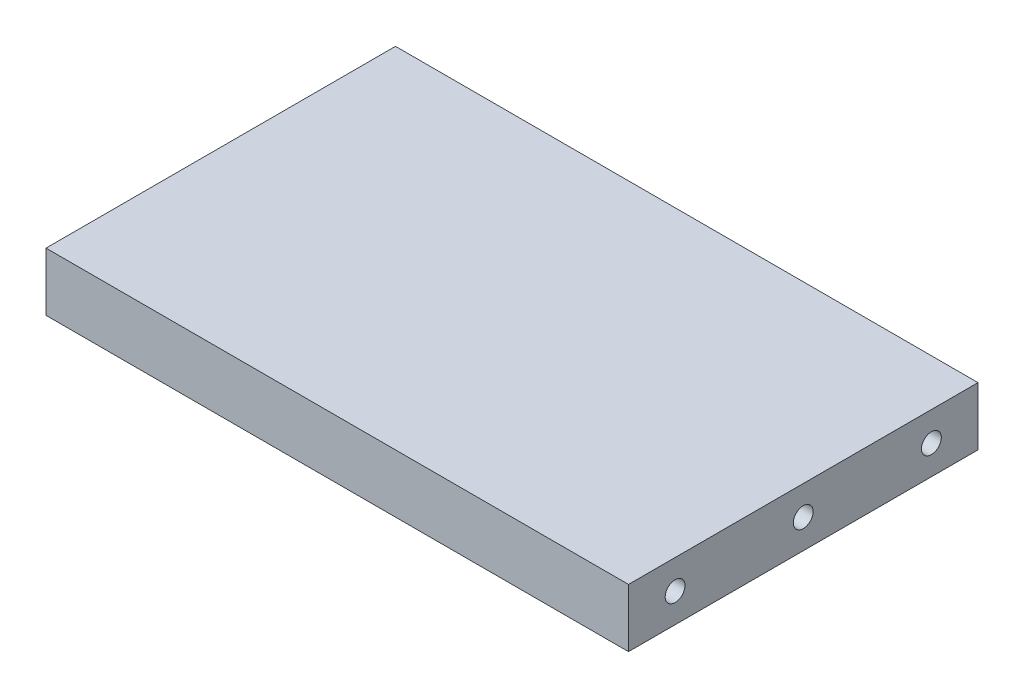
ISO-10303-21;
HEADER;
FILE_DESCRIPTION(('STEP AP214'),'2;1');
FILE_NAME('part.step','',(''),(''),'','','');
FILE_SCHEMA(('AUTOMOTIVE_DESIGN { 1 0 10303 214 1 1 1 1 }'));
ENDSEC;
DATA;
#1=APPLICATION_CONTEXT('core data for automotive mechanical design processes');
#2=APPLICATION_PROTOCOL_DEFINITION('international standard','automotive_design',2000,#1);
#3=PRODUCT_CONTEXT('',#1,'mechanical');
#4=PRODUCT('Part','Part','',(#3));
#5=PRODUCT_RELATED_PRODUCT_CATEGORY('part','',(#4));
#6=PRODUCT_DEFINITION_FORMATION('','',#4);
#7=PRODUCT_DEFINITION_CONTEXT('part definition',#1,'design');
#8=PRODUCT_DEFINITION('design','',#6,#7);
#9=PRODUCT_DEFINITION_SHAPE('','',#8);
#10=(LENGTH_UNIT() NAMED_UNIT(*) SI_UNIT(.MILLI.,.METRE.));
#11=(NAMED_UNIT(*) PLANE_ANGLE_UNIT() SI_UNIT($,.RADIAN.));
#12=(NAMED_UNIT(*) SI_UNIT($,.STERADIAN.) SOLID_ANGLE_UNIT());
#13=UNCERTAINTY_MEASURE_WITH_UNIT(LENGTH_MEASURE(1.E-05),#10,'distance_accuracy_value','');
#14=(GEOMETRIC_REPRESENTATION_CONTEXT(3) GLOBAL_UNCERTAINTY_ASSIGNED_CONTEXT((#13)) GLOBAL_UNIT_ASSIGNED_CONTEXT((#10,
#11,#12)) REPRESENTATION_CONTEXT('',''));
#15=CARTESIAN_POINT('',(0.,0.,0.));
#16=DIRECTION('',(0.,0.,1.));
#17=DIRECTION('',(1.,0.,0.));
#18=AXIS2_PLACEMENT_3D('',#15,#16,#17);
#19=CARTESIAN_POINT('',(50.,10.,30.));
#20=DIRECTION('',(-1.,0.,0.));
#21=DIRECTION('',(0.,0.,1.));
#22=AXIS2_PLACEMENT_3D('',#19,#20,#21);
#23=PLANE('',#22);
#24=CARTESIAN_POINT('',(50.,5.,-22.0000000000002));
#25=DIRECTION('',(-1.,0.,0.));
#26=DIRECTION('',(0.,0.,1.));
#27=AXIS2_PLACEMENT_3D('',#24,#25,#26);
#28=CIRCLE('',#27,1.69999999999999);
#29=CARTESIAN_POINT('',(50.,5.,-20.3000000000002));
#30=VERTEX_POINT('',#29);
#31=EDGE_CURVE('E131',#30,#30,#28,.T.);
#32=ORIENTED_EDGE('',*,*,#31,.T.);
#33=EDGE_LOOP('',(#32));
#34=FACE_BOUND('',#33,.T.);
#35=CARTESIAN_POINT('',(50.,5.,21.9999999999998));
#36=DIRECTION('',(-1.,0.,0.));
#37=DIRECTION('',(0.,0.,1.));
#38=AXIS2_PLACEMENT_3D('',#35,#36,#37);
#39=CIRCLE('',#38,1.69999999999999);
#40=CARTESIAN_POINT('',(50.,5.,23.6999999999998));
#41=VERTEX_POINT('',#40);
#42=EDGE_CURVE('E135',#41,#41,#39,.T.);
#43=ORIENTED_EDGE('',*,*,#42,.T.);
#44=EDGE_LOOP('',(#43));
#45=FACE_BOUND('',#44,.T.);
#46=CARTESIAN_POINT('',(50.,5.,-2.22044604925031E-13));
#47=DIRECTION('',(-1.,0.,0.));
#48=DIRECTION('',(0.,0.,1.));
#49=AXIS2_PLACEMENT_3D('',#46,#47,#48);
#50=CIRCLE('',#49,1.69999999999999);
#51=CARTESIAN_POINT('',(50.,5.,1.69999999999977));
#52=VERTEX_POINT('',#51);
#53=EDGE_CURVE('E139',#52,#52,#50,.T.);
#54=ORIENTED_EDGE('',*,*,#53,.T.);
#55=EDGE_LOOP('',(#54));
#56=FACE_BOUND('',#55,.T.);
#57=DIRECTION('',(0.,0.,-1.));
#58=VECTOR('',#57,1.);
#59=CARTESIAN_POINT('',(50.,0.,30.));
#60=LINE('',#59,#58);
#61=CARTESIAN_POINT('',(50.,0.,30.));
#62=VERTEX_POINT('',#61);
#63=CARTESIAN_POINT('',(50.,0.,-30.));
#64=VERTEX_POINT('',#63);
#65=EDGE_CURVE('E147',#62,#64,#60,.T.);
#66=ORIENTED_EDGE('',*,*,#65,.T.);
#67=DIRECTION('',(0.,-1.,0.));
#68=VECTOR('',#67,1.);
#69=CARTESIAN_POINT('',(50.,10.,-30.));
#70=LINE('',#69,#68);
#71=CARTESIAN_POINT('',(50.,10.,-30.));
#72=VERTEX_POINT('',#71);
#73=EDGE_CURVE('E11',#72,#64,#70,.T.);
#74=ORIENTED_EDGE('',*,*,#73,.F.);
#75=DIRECTION('',(0.,0.,-1.));
#76=VECTOR('',#75,1.);
#77=CARTESIAN_POINT('',(50.,10.,30.));
#78=LINE('',#77,#76);
#79=CARTESIAN_POINT('',(50.,10.,30.));
#80=VERTEX_POINT('',#79);
#81=EDGE_CURVE('E140',#80,#72,#78,.T.);
#82=ORIENTED_EDGE('',*,*,#81,.F.);
#83=DIRECTION('',(0.,-1.,0.));
#84=VECTOR('',#83,1.);
#85=CARTESIAN_POINT('',(50.,10.,30.));
#86=LINE('',#85,#84);
#87=EDGE_CURVE('E146',#80,#62,#86,.T.);
#88=ORIENTED_EDGE('',*,*,#87,.T.);
#89=EDGE_LOOP('',(#66,#74,#82,#88));
#90=FACE_BOUND('',#89,.T.);
#91=ADVANCED_FACE('F40',(#34,#45,#56,#90),#23,.F.);
#92=CARTESIAN_POINT('',(-50.,10.,-30.));
#93=DIRECTION('',(0.,0.,1.));
#94=DIRECTION('',(1.,0.,0.));
#95=AXIS2_PLACEMENT_3D('',#92,#93,#94);
#96=PLANE('',#95);
#97=DIRECTION('',(-1.,0.,0.));
#98=VECTOR('',#97,1.);
#99=CARTESIAN_POINT('',(-50.,0.,-30.));
#100=LINE('',#99,#98);
#101=CARTESIAN_POINT('',(-50.,0.,-30.));
#102=VERTEX_POINT('',#101);
#103=EDGE_CURVE('E150',#64,#102,#100,.T.);
#104=ORIENTED_EDGE('',*,*,#103,.T.);
#105=DIRECTION('',(0.,-1.,0.));
#106=VECTOR('',#105,1.);
#107=CARTESIAN_POINT('',(-50.,10.,-30.));
#108=LINE('',#107,#106);
#109=CARTESIAN_POINT('',(-50.,10.,-30.));
#110=VERTEX_POINT('',#109);
#111=EDGE_CURVE('E49',#110,#102,#108,.T.);
#112=ORIENTED_EDGE('',*,*,#111,.F.);
#113=DIRECTION('',(-1.,0.,0.));
#114=VECTOR('',#113,1.);
#115=CARTESIAN_POINT('',(-50.,10.,-30.));
#116=LINE('',#115,#114);
#117=EDGE_CURVE('E89',#72,#110,#116,.T.);
#118=ORIENTED_EDGE('',*,*,#117,.F.);
#119=ORIENTED_EDGE('',*,*,#73,.T.);
#120=EDGE_LOOP('',(#104,#112,#118,#119));
#121=FACE_BOUND('',#120,.T.);
#122=ADVANCED_FACE('F188',(#121),#96,.F.);
#123=CARTESIAN_POINT('',(-50.,10.,30.));
#124=DIRECTION('',(1.,0.,0.));
#125=DIRECTION('',(0.,0.,-1.));
#126=AXIS2_PLACEMENT_3D('',#123,#124,#125);
#127=PLANE('',#126);
#128=CARTESIAN_POINT('',(-50.,5.,-22.0000000000002));
#129=DIRECTION('',(1.,0.,0.));
#130=DIRECTION('',(0.,0.,-1.));
#131=AXIS2_PLACEMENT_3D('',#128,#129,#130);
#132=CIRCLE('',#131,1.69999999999999);
#133=CARTESIAN_POINT('',(-50.,5.,-23.7000000000002));
#134=VERTEX_POINT('',#133);
#135=EDGE_CURVE('E43',#134,#134,#132,.T.);
#136=ORIENTED_EDGE('',*,*,#135,.T.);
#137=EDGE_LOOP('',(#136));
#138=FACE_BOUND('',#137,.T.);
#139=CARTESIAN_POINT('',(-50.,5.,21.9999999999998));
#140=DIRECTION('',(1.,0.,0.));
#141=DIRECTION('',(0.,0.,-1.));
#142=AXIS2_PLACEMENT_3D('',#139,#140,#141);
#143=CIRCLE('',#142,1.69999999999999);
#144=CARTESIAN_POINT('',(-50.,5.,20.2999999999998));
#145=VERTEX_POINT('',#144);
#146=EDGE_CURVE('E123',#145,#145,#143,.T.);
#147=ORIENTED_EDGE('',*,*,#146,.T.);
#148=EDGE_LOOP('',(#147));
#149=FACE_BOUND('',#148,.T.);
#150=CARTESIAN_POINT('',(-50.,5.,-2.22044604925031E-13));
#151=DIRECTION('',(1.,0.,0.));
#152=DIRECTION('',(0.,0.,-1.));
#153=AXIS2_PLACEMENT_3D('',#150,#151,#152);
#154=CIRCLE('',#153,1.69999999999999);
#155=CARTESIAN_POINT('',(-50.,5.,-1.70000000000022));
#156=VERTEX_POINT('',#155);
#157=EDGE_CURVE('E127',#156,#156,#154,.T.);
#158=ORIENTED_EDGE('',*,*,#157,.T.);
#159=EDGE_LOOP('',(#158));
#160=FACE_BOUND('',#159,.T.);
#161=DIRECTION('',(0.,0.,1.));
#162=VECTOR('',#161,1.);
#163=CARTESIAN_POINT('',(-50.,0.,30.));
#164=LINE('',#163,#162);
#165=CARTESIAN_POINT('',(-50.,0.,30.));
#166=VERTEX_POINT('',#165);
#167=EDGE_CURVE('E76',#102,#166,#164,.T.);
#168=ORIENTED_EDGE('',*,*,#167,.T.);
#169=DIRECTION('',(0.,-1.,0.));
#170=VECTOR('',#169,1.);
#171=CARTESIAN_POINT('',(-50.,10.,30.));
#172=LINE('',#171,#170);
#173=CARTESIAN_POINT('',(-50.,10.,30.));
#174=VERTEX_POINT('',#173);
#175=EDGE_CURVE('E155',#174,#166,#172,.T.);
#176=ORIENTED_EDGE('',*,*,#175,.F.);
#177=DIRECTION('',(0.,0.,1.));
#178=VECTOR('',#177,1.);
#179=CARTESIAN_POINT('',(-50.,10.,30.));
#180=LINE('',#179,#178);
#181=EDGE_CURVE('E143',#110,#174,#180,.T.);
#182=ORIENTED_EDGE('',*,*,#181,.F.);
#183=ORIENTED_EDGE('',*,*,#111,.T.);
#184=EDGE_LOOP('',(#168,#176,#182,#183));
#185=FACE_BOUND('',#184,.T.);
#186=ADVANCED_FACE('F168',(#138,#149,#160,#185),#127,.F.);
#187=CARTESIAN_POINT('',(-50.,10.,30.));
#188=DIRECTION('',(0.,0.,-1.));
#189=DIRECTION('',(-1.,0.,0.));
#190=AXIS2_PLACEMENT_3D('',#187,#188,#189);
#191=PLANE('',#190);
#192=DIRECTION('',(1.,0.,0.));
#193=VECTOR('',#192,1.);
#194=CARTESIAN_POINT('',(-50.,0.,30.));
#195=LINE('',#194,#193);
#196=EDGE_CURVE('E82',#166,#62,#195,.T.);
#197=ORIENTED_EDGE('',*,*,#196,.T.);
#198=ORIENTED_EDGE('',*,*,#87,.F.);
#199=DIRECTION('',(1.,0.,0.));
#200=VECTOR('',#199,1.);
#201=CARTESIAN_POINT('',(-50.,10.,30.));
#202=LINE('',#201,#200);
#203=EDGE_CURVE('E58',#174,#80,#202,.T.);
#204=ORIENTED_EDGE('',*,*,#203,.F.);
#205=ORIENTED_EDGE('',*,*,#175,.T.);
#206=EDGE_LOOP('',(#197,#198,#204,#205));
#207=FACE_BOUND('',#206,.T.);
#208=ADVANCED_FACE('F209',(#207),#191,.F.);
#209=CARTESIAN_POINT('',(0.,10.,0.));
#210=DIRECTION('',(0.,-1.,0.));
#211=DIRECTION('',(0.,0.,-1.));
#212=AXIS2_PLACEMENT_3D('',#209,#210,#211);
#213=PLANE('',#212);
#214=ORIENTED_EDGE('',*,*,#81,.T.);
#215=ORIENTED_EDGE('',*,*,#117,.T.);
#216=ORIENTED_EDGE('',*,*,#181,.T.);
#217=ORIENTED_EDGE('',*,*,#203,.T.);
#218=EDGE_LOOP('',(#214,#215,#216,#217));
#219=FACE_BOUND('',#218,.T.);
#220=ADVANCED_FACE('F207',(#219),#213,.F.);
#221=CARTESIAN_POINT('',(0.,0.,0.));
#222=DIRECTION('',(0.,-1.,0.));
#223=DIRECTION('',(0.,0.,-1.));
#224=AXIS2_PLACEMENT_3D('',#221,#222,#223);
#225=PLANE('',#224);
#226=ORIENTED_EDGE('',*,*,#65,.F.);
#227=ORIENTED_EDGE('',*,*,#196,.F.);
#228=ORIENTED_EDGE('',*,*,#167,.F.);
#229=ORIENTED_EDGE('',*,*,#103,.F.);
#230=EDGE_LOOP('',(#226,#227,#228,#229));
#231=FACE_BOUND('',#230,.T.);
#232=ADVANCED_FACE('F205',(#231),#225,.T.);
#233=CARTESIAN_POINT('',(60.0000000000001,5.,-2.22044604925031E-13));
#234=DIRECTION('',(1.,0.,0.));
#235=DIRECTION('',(0.,0.,-1.));
#236=AXIS2_PLACEMENT_3D('',#233,#234,#235);
#237=CYLINDRICAL_SURFACE('',#236,1.69999999999999);
#238=CARTESIAN_POINT('',(37.0000000000001,5.,-2.22044604925031E-13));
#239=DIRECTION('',(1.,0.,0.));
#240=DIRECTION('',(0.,0.,-1.));
#241=AXIS2_PLACEMENT_3D('',#238,#239,#240);
#242=CIRCLE('',#241,1.69999999999999);
#243=CARTESIAN_POINT('',(37.0000000000001,5.,-1.70000000000022));
#244=VERTEX_POINT('',#243);
#245=EDGE_CURVE('E136',#244,#244,#242,.T.);
#246=ORIENTED_EDGE('',*,*,#245,.F.);
#247=EDGE_LOOP('',(#246));
#248=FACE_BOUND('',#247,.T.);
#249=ORIENTED_EDGE('',*,*,#53,.F.);
#250=EDGE_LOOP('',(#249));
#251=FACE_BOUND('',#250,.T.);
#252=ADVANCED_FACE('F214',(#248,#251),#237,.F.);
#253=CARTESIAN_POINT('',(37.0000000000001,5.,-2.22044604925031E-13));
#254=DIRECTION('',(1.,0.,0.));
#255=DIRECTION('',(0.,0.,-1.));
#256=AXIS2_PLACEMENT_3D('',#253,#254,#255);
#257=CONICAL_SURFACE('',#256,1.69999999999999,1.02974425867665);
#258=CARTESIAN_POINT('',(35.9785369476532,5.,-2.22044604925031E-13));
#259=VERTEX_POINT('',#258);
#260=VERTEX_LOOP('',#259);
#261=FACE_BOUND('',#260,.T.);
#262=ORIENTED_EDGE('',*,*,#245,.T.);
#263=EDGE_LOOP('',(#262));
#264=FACE_BOUND('',#263,.T.);
#265=ADVANCED_FACE('F218',(#261,#264),#257,.F.);
#266=CARTESIAN_POINT('',(60.0000000000001,5.,21.9999999999998));
#267=DIRECTION('',(1.,0.,0.));
#268=DIRECTION('',(0.,0.,-1.));
#269=AXIS2_PLACEMENT_3D('',#266,#267,#268);
#270=CYLINDRICAL_SURFACE('',#269,1.69999999999999);
#271=CARTESIAN_POINT('',(37.0000000000001,5.,21.9999999999998));
#272=DIRECTION('',(1.,0.,0.));
#273=DIRECTION('',(0.,0.,-1.));
#274=AXIS2_PLACEMENT_3D('',#271,#272,#273);
#275=CIRCLE('',#274,1.69999999999999);
#276=CARTESIAN_POINT('',(37.0000000000001,5.,20.2999999999998));
#277=VERTEX_POINT('',#276);
#278=EDGE_CURVE('E132',#277,#277,#275,.T.);
#279=ORIENTED_EDGE('',*,*,#278,.F.);
#280=EDGE_LOOP('',(#279));
#281=FACE_BOUND('',#280,.T.);
#282=ORIENTED_EDGE('',*,*,#42,.F.);
#283=EDGE_LOOP('',(#282));
#284=FACE_BOUND('',#283,.T.);
#285=ADVANCED_FACE('F288',(#281,#284),#270,.F.);
#286=CARTESIAN_POINT('',(37.0000000000001,5.,21.9999999999998));
#287=DIRECTION('',(1.,0.,0.));
#288=DIRECTION('',(0.,0.,-1.));
#289=AXIS2_PLACEMENT_3D('',#286,#287,#288);
#290=CONICAL_SURFACE('',#289,1.69999999999999,1.02974425867665);
#291=CARTESIAN_POINT('',(35.9785369476532,5.,21.9999999999998));
#292=VERTEX_POINT('',#291);
#293=VERTEX_LOOP('',#292);
#294=FACE_BOUND('',#293,.T.);
#295=ORIENTED_EDGE('',*,*,#278,.T.);
#296=EDGE_LOOP('',(#295));
#297=FACE_BOUND('',#296,.T.);
#298=ADVANCED_FACE('F279',(#294,#297),#290,.F.);
#299=CARTESIAN_POINT('',(60.0000000000001,5.,-22.0000000000002));
#300=DIRECTION('',(1.,0.,0.));
#301=DIRECTION('',(0.,0.,-1.));
#302=AXIS2_PLACEMENT_3D('',#299,#300,#301);
#303=CYLINDRICAL_SURFACE('',#302,1.69999999999999);
#304=CARTESIAN_POINT('',(37.0000000000001,5.,-22.0000000000002));
#305=DIRECTION('',(1.,0.,0.));
#306=DIRECTION('',(0.,0.,-1.));
#307=AXIS2_PLACEMENT_3D('',#304,#305,#306);
#308=CIRCLE('',#307,1.69999999999999);
#309=CARTESIAN_POINT('',(37.0000000000001,5.,-23.7000000000002));
#310=VERTEX_POINT('',#309);
#311=EDGE_CURVE('E128',#310,#310,#308,.T.);
#312=ORIENTED_EDGE('',*,*,#311,.F.);
#313=EDGE_LOOP('',(#312));
#314=FACE_BOUND('',#313,.T.);
#315=ORIENTED_EDGE('',*,*,#31,.F.);
#316=EDGE_LOOP('',(#315));
#317=FACE_BOUND('',#316,.T.);
#318=ADVANCED_FACE('F270',(#314,#317),#303,.F.);
#319=CARTESIAN_POINT('',(37.0000000000001,5.,-22.0000000000002));
#320=DIRECTION('',(1.,0.,0.));
#321=DIRECTION('',(0.,0.,-1.));
#322=AXIS2_PLACEMENT_3D('',#319,#320,#321);
#323=CONICAL_SURFACE('',#322,1.69999999999999,1.02974425867665);
#324=CARTESIAN_POINT('',(35.9785369476532,5.,-22.0000000000002));
#325=VERTEX_POINT('',#324);
#326=VERTEX_LOOP('',#325);
#327=FACE_BOUND('',#326,.T.);
#328=ORIENTED_EDGE('',*,*,#311,.T.);
#329=EDGE_LOOP('',(#328));
#330=FACE_BOUND('',#329,.T.);
#331=ADVANCED_FACE('F262',(#327,#330),#323,.F.);
#332=CARTESIAN_POINT('',(-60.0000000000001,5.,-2.22044604925031E-13));
#333=DIRECTION('',(-1.,0.,0.));
#334=DIRECTION('',(0.,0.,1.));
#335=AXIS2_PLACEMENT_3D('',#332,#333,#334);
#336=CYLINDRICAL_SURFACE('',#335,1.69999999999999);
#337=CARTESIAN_POINT('',(-37.0000000000001,5.,-2.22044604925031E-13));
#338=DIRECTION('',(-1.,0.,0.));
#339=DIRECTION('',(0.,0.,1.));
#340=AXIS2_PLACEMENT_3D('',#337,#338,#339);
#341=CIRCLE('',#340,1.69999999999999);
#342=CARTESIAN_POINT('',(-37.0000000000001,5.,1.69999999999977));
#343=VERTEX_POINT('',#342);
#344=EDGE_CURVE('E124',#343,#343,#341,.T.);
#345=ORIENTED_EDGE('',*,*,#344,.F.);
#346=EDGE_LOOP('',(#345));
#347=FACE_BOUND('',#346,.T.);
#348=ORIENTED_EDGE('',*,*,#157,.F.);
#349=EDGE_LOOP('',(#348));
#350=FACE_BOUND('',#349,.T.);
#351=ADVANCED_FACE('F183',(#347,#350),#336,.F.);
#352=CARTESIAN_POINT('',(-37.0000000000001,5.,-2.22044604925031E-13));
#353=DIRECTION('',(-1.,0.,0.));
#354=DIRECTION('',(0.,0.,1.));
#355=AXIS2_PLACEMENT_3D('',#352,#353,#354);
#356=CONICAL_SURFACE('',#355,1.69999999999999,1.02974425867665);
#357=CARTESIAN_POINT('',(-35.9785369476532,5.,-2.22044604925031E-13));
#358=VERTEX_POINT('',#357);
#359=VERTEX_LOOP('',#358);
#360=FACE_BOUND('',#359,.T.);
#361=ORIENTED_EDGE('',*,*,#344,.T.);
#362=EDGE_LOOP('',(#361));
#363=FACE_BOUND('',#362,.T.);
#364=ADVANCED_FACE('F174',(#360,#363),#356,.F.);
#365=CARTESIAN_POINT('',(-60.0000000000001,5.,21.9999999999998));
#366=DIRECTION('',(-1.,0.,0.));
#367=DIRECTION('',(0.,0.,1.));
#368=AXIS2_PLACEMENT_3D('',#365,#366,#367);
#369=CYLINDRICAL_SURFACE('',#368,1.69999999999999);
#370=CARTESIAN_POINT('',(-37.0000000000001,5.,21.9999999999998));
#371=DIRECTION('',(-1.,0.,0.));
#372=DIRECTION('',(0.,0.,1.));
#373=AXIS2_PLACEMENT_3D('',#370,#371,#372);
#374=CIRCLE('',#373,1.69999999999999);
#375=CARTESIAN_POINT('',(-37.0000000000001,5.,23.6999999999998));
#376=VERTEX_POINT('',#375);
#377=EDGE_CURVE('E119',#376,#376,#374,.T.);
#378=ORIENTED_EDGE('',*,*,#377,.F.);
#379=EDGE_LOOP('',(#378));
#380=FACE_BOUND('',#379,.T.);
#381=ORIENTED_EDGE('',*,*,#146,.F.);
#382=EDGE_LOOP('',(#381));
#383=FACE_BOUND('',#382,.T.);
#384=ADVANCED_FACE('F171',(#380,#383),#369,.F.);
#385=CARTESIAN_POINT('',(-37.0000000000001,5.,21.9999999999998));
#386=DIRECTION('',(-1.,0.,0.));
#387=DIRECTION('',(0.,0.,1.));
#388=AXIS2_PLACEMENT_3D('',#385,#386,#387);
#389=CONICAL_SURFACE('',#388,1.69999999999999,1.02974425867665);
#390=CARTESIAN_POINT('',(-35.9785369476532,5.,21.9999999999998));
#391=VERTEX_POINT('',#390);
#392=VERTEX_LOOP('',#391);
#393=FACE_BOUND('',#392,.T.);
#394=ORIENTED_EDGE('',*,*,#377,.T.);
#395=EDGE_LOOP('',(#394));
#396=FACE_BOUND('',#395,.T.);
#397=ADVANCED_FACE('F173',(#393,#396),#389,.F.);
#398=CARTESIAN_POINT('',(-60.0000000000001,5.,-22.0000000000002));
#399=DIRECTION('',(-1.,0.,0.));
#400=DIRECTION('',(0.,0.,1.));
#401=AXIS2_PLACEMENT_3D('',#398,#399,#400);
#402=CYLINDRICAL_SURFACE('',#401,1.69999999999999);
#403=CARTESIAN_POINT('',(-37.0000000000001,5.,-22.0000000000002));
#404=DIRECTION('',(-1.,0.,0.));
#405=DIRECTION('',(0.,0.,1.));
#406=AXIS2_PLACEMENT_3D('',#403,#404,#405);
#407=CIRCLE('',#406,1.69999999999999);
#408=CARTESIAN_POINT('',(-37.0000000000001,5.,-20.3000000000002));
#409=VERTEX_POINT('',#408);
#410=EDGE_CURVE('E115',#409,#409,#407,.T.);
#411=ORIENTED_EDGE('',*,*,#410,.F.);
#412=EDGE_LOOP('',(#411));
#413=FACE_BOUND('',#412,.T.);
#414=ORIENTED_EDGE('',*,*,#135,.F.);
#415=EDGE_LOOP('',(#414));
#416=FACE_BOUND('',#415,.T.);
#417=ADVANCED_FACE('F111',(#413,#416),#402,.F.);
#418=CARTESIAN_POINT('',(-37.0000000000001,5.,-22.0000000000002));
#419=DIRECTION('',(-1.,0.,0.));
#420=DIRECTION('',(0.,0.,1.));
#421=AXIS2_PLACEMENT_3D('',#418,#419,#420);
#422=CONICAL_SURFACE('',#421,1.69999999999999,1.02974425867665);
#423=CARTESIAN_POINT('',(-35.9785369476532,5.,-22.0000000000002));
#424=VERTEX_POINT('',#423);
#425=VERTEX_LOOP('',#424);
#426=FACE_BOUND('',#425,.T.);
#427=ORIENTED_EDGE('',*,*,#410,.T.);
#428=EDGE_LOOP('',(#427));
#429=FACE_BOUND('',#428,.T.);
#430=ADVANCED_FACE('F108',(#426,#429),#422,.F.);
#431=CLOSED_SHELL('',(#91,#122,#186,#208,#220,#232,#252,#265,#285,#298,#318,#331,#351,#364,#384,
#397,#417,#430));
#432=MANIFOLD_SOLID_BREP('B2',#431);
#433=ADVANCED_BREP_SHAPE_REPRESENTATION('',(#18,#432),#14);
#434=SHAPE_DEFINITION_REPRESENTATION(#9,#433);
ENDSEC;
END-ISO-10303-21;
